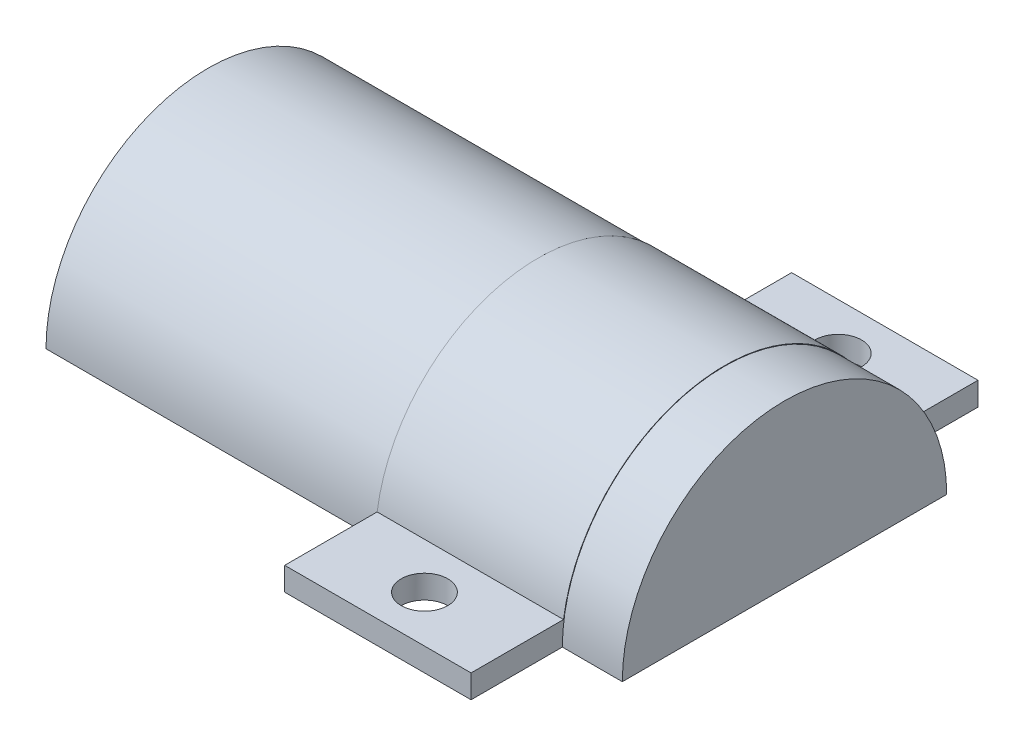
ISO-10303-21;
HEADER;
FILE_DESCRIPTION(('STEP AP214'),'2;1');
FILE_NAME('part.step','',(''),(''),'','','');
FILE_SCHEMA(('AUTOMOTIVE_DESIGN { 1 0 10303 214 1 1 1 1 }'));
ENDSEC;
DATA;
#1=APPLICATION_CONTEXT('core data for automotive mechanical design processes');
#2=APPLICATION_PROTOCOL_DEFINITION('international standard','automotive_design',2000,#1);
#3=PRODUCT_CONTEXT('',#1,'mechanical');
#4=PRODUCT('Part','Part','',(#3));
#5=PRODUCT_RELATED_PRODUCT_CATEGORY('part','',(#4));
#6=PRODUCT_DEFINITION_FORMATION('','',#4);
#7=PRODUCT_DEFINITION_CONTEXT('part definition',#1,'design');
#8=PRODUCT_DEFINITION('design','',#6,#7);
#9=PRODUCT_DEFINITION_SHAPE('','',#8);
#10=(LENGTH_UNIT() NAMED_UNIT(*) SI_UNIT(.MILLI.,.METRE.));
#11=(NAMED_UNIT(*) PLANE_ANGLE_UNIT() SI_UNIT($,.RADIAN.));
#12=(NAMED_UNIT(*) SI_UNIT($,.STERADIAN.) SOLID_ANGLE_UNIT());
#13=UNCERTAINTY_MEASURE_WITH_UNIT(LENGTH_MEASURE(1.E-05),#10,'distance_accuracy_value','');
#14=(GEOMETRIC_REPRESENTATION_CONTEXT(3) GLOBAL_UNCERTAINTY_ASSIGNED_CONTEXT((#13)) GLOBAL_UNIT_ASSIGNED_CONTEXT((#10,
#11,#12)) REPRESENTATION_CONTEXT('',''));
#15=CARTESIAN_POINT('',(0.,0.,0.));
#16=DIRECTION('',(0.,0.,1.));
#17=DIRECTION('',(1.,0.,0.));
#18=AXIS2_PLACEMENT_3D('',#15,#16,#17);
#19=CARTESIAN_POINT('',(25.4,0.,0.));
#20=DIRECTION('',(-1.,0.,0.));
#21=DIRECTION('',(0.,0.,1.));
#22=AXIS2_PLACEMENT_3D('',#19,#20,#21);
#23=CYLINDRICAL_SURFACE('',#22,19.);
#24=DIRECTION('',(-1.,0.,0.));
#25=VECTOR('',#24,1.);
#26=CARTESIAN_POINT('',(25.4,0.,19.));
#27=LINE('',#26,#25);
#28=CARTESIAN_POINT('',(30.4,0.,19.));
#29=VERTEX_POINT('',#28);
#30=CARTESIAN_POINT('',(-45.,0.,19.));
#31=VERTEX_POINT('',#30);
#32=EDGE_CURVE('E11',#29,#31,#27,.T.);
#33=ORIENTED_EDGE('',*,*,#32,.T.);
#34=CARTESIAN_POINT('',(-45.,0.,0.));
#35=DIRECTION('',(-1.,0.,0.));
#36=DIRECTION('',(0.,0.,1.));
#37=AXIS2_PLACEMENT_3D('',#34,#35,#36);
#38=CIRCLE('',#37,19.);
#39=CARTESIAN_POINT('',(-45.,0.,-19.));
#40=VERTEX_POINT('',#39);
#41=EDGE_CURVE('E140',#40,#31,#38,.F.);
#42=ORIENTED_EDGE('',*,*,#41,.F.);
#43=DIRECTION('',(-1.,0.,0.));
#44=VECTOR('',#43,1.);
#45=CARTESIAN_POINT('',(25.4,0.,-19.));
#46=LINE('',#45,#44);
#47=CARTESIAN_POINT('',(30.4,0.,-19.));
#48=VERTEX_POINT('',#47);
#49=EDGE_CURVE('E43',#48,#40,#46,.T.);
#50=ORIENTED_EDGE('',*,*,#49,.F.);
#51=CARTESIAN_POINT('',(30.4,0.,0.));
#52=DIRECTION('',(1.,0.,0.));
#53=DIRECTION('',(0.,0.,-1.));
#54=AXIS2_PLACEMENT_3D('',#51,#52,#53);
#55=CIRCLE('',#54,19.);
#56=EDGE_CURVE('E160',#29,#48,#55,.F.);
#57=ORIENTED_EDGE('',*,*,#56,.F.);
#58=EDGE_LOOP('',(#33,#42,#50,#57));
#59=FACE_BOUND('',#58,.T.);
#60=ADVANCED_FACE('F36',(#59),#23,.F.);
#61=CARTESIAN_POINT('',(25.4,0.,0.));
#62=DIRECTION('',(0.,1.,0.));
#63=DIRECTION('',(0.,0.,1.));
#64=AXIS2_PLACEMENT_3D('',#61,#62,#63);
#65=PLANE('',#64);
#66=CARTESIAN_POINT('',(12.7,0.,-28.1965259209744));
#67=DIRECTION('',(0.,1.,0.));
#68=DIRECTION('',(0.,0.,1.));
#69=AXIS2_PLACEMENT_3D('',#66,#67,#68);
#70=CIRCLE('',#69,3.175);
#71=CARTESIAN_POINT('',(12.7,0.,-25.0215259209744));
#72=VERTEX_POINT('',#71);
#73=EDGE_CURVE('E173',#72,#72,#70,.T.);
#74=ORIENTED_EDGE('',*,*,#73,.T.);
#75=EDGE_LOOP('',(#74));
#76=FACE_BOUND('',#75,.T.);
#77=ORIENTED_EDGE('',*,*,#49,.T.);
#78=DIRECTION('',(0.,0.,1.));
#79=VECTOR('',#78,1.);
#80=CARTESIAN_POINT('',(-45.,0.,0.));
#81=LINE('',#80,#79);
#82=CARTESIAN_POINT('',(-45.,0.,-22.0796898983033));
#83=VERTEX_POINT('',#82);
#84=EDGE_CURVE('E133',#83,#40,#81,.T.);
#85=ORIENTED_EDGE('',*,*,#84,.F.);
#86=DIRECTION('',(1.,0.,0.));
#87=VECTOR('',#86,1.);
#88=CARTESIAN_POINT('',(-45.,0.,-22.0796898983033));
#89=LINE('',#88,#87);
#90=CARTESIAN_POINT('',(0.,0.,-22.0796898983033));
#91=VERTEX_POINT('',#90);
#92=EDGE_CURVE('E129',#83,#91,#89,.T.);
#93=ORIENTED_EDGE('',*,*,#92,.T.);
#94=DIRECTION('',(0.,0.,-1.));
#95=VECTOR('',#94,1.);
#96=CARTESIAN_POINT('',(0.,0.,0.));
#97=LINE('',#96,#95);
#98=CARTESIAN_POINT('',(0.,0.,-34.5465259209744));
#99=VERTEX_POINT('',#98);
#100=EDGE_CURVE('E201',#91,#99,#97,.T.);
#101=ORIENTED_EDGE('',*,*,#100,.T.);
#102=DIRECTION('',(-1.,0.,0.));
#103=VECTOR('',#102,1.);
#104=CARTESIAN_POINT('',(25.4,0.,-34.5465259209744));
#105=LINE('',#104,#103);
#106=CARTESIAN_POINT('',(25.4,0.,-34.5465259209744));
#107=VERTEX_POINT('',#106);
#108=EDGE_CURVE('E226',#107,#99,#105,.T.);
#109=ORIENTED_EDGE('',*,*,#108,.F.);
#110=DIRECTION('',(0.,0.,-1.));
#111=VECTOR('',#110,1.);
#112=CARTESIAN_POINT('',(25.4,0.,0.));
#113=LINE('',#112,#111);
#114=CARTESIAN_POINT('',(25.4,0.,-22.1046519776116));
#115=VERTEX_POINT('',#114);
#116=EDGE_CURVE('E184',#115,#107,#113,.T.);
#117=ORIENTED_EDGE('',*,*,#116,.F.);
#118=DIRECTION('',(-1.,0.,0.));
#119=VECTOR('',#118,1.);
#120=CARTESIAN_POINT('',(30.4,0.,-22.1046519776116));
#121=LINE('',#120,#119);
#122=CARTESIAN_POINT('',(33.575,0.,-22.1046519776116));
#123=VERTEX_POINT('',#122);
#124=EDGE_CURVE('E167',#123,#115,#121,.T.);
#125=ORIENTED_EDGE('',*,*,#124,.F.);
#126=DIRECTION('',(0.,0.,-1.));
#127=VECTOR('',#126,1.);
#128=CARTESIAN_POINT('',(33.575,0.,0.));
#129=LINE('',#128,#127);
#130=CARTESIAN_POINT('',(33.575,0.,22.1046519776116));
#131=VERTEX_POINT('',#130);
#132=EDGE_CURVE('E150',#131,#123,#129,.T.);
#133=ORIENTED_EDGE('',*,*,#132,.F.);
#134=DIRECTION('',(-1.,0.,0.));
#135=VECTOR('',#134,1.);
#136=CARTESIAN_POINT('',(30.4,0.,22.1046519776116));
#137=LINE('',#136,#135);
#138=CARTESIAN_POINT('',(25.4,0.,22.1046519776116));
#139=VERTEX_POINT('',#138);
#140=EDGE_CURVE('E163',#131,#139,#137,.T.);
#141=ORIENTED_EDGE('',*,*,#140,.T.);
#142=DIRECTION('',(0.,0.,1.));
#143=VECTOR('',#142,1.);
#144=CARTESIAN_POINT('',(25.4,0.,0.));
#145=LINE('',#144,#143);
#146=CARTESIAN_POINT('',(25.4,0.,34.5465259209744));
#147=VERTEX_POINT('',#146);
#148=EDGE_CURVE('E182',#139,#147,#145,.T.);
#149=ORIENTED_EDGE('',*,*,#148,.T.);
#150=DIRECTION('',(-1.,0.,0.));
#151=VECTOR('',#150,1.);
#152=CARTESIAN_POINT('',(25.4,0.,34.5465259209744));
#153=LINE('',#152,#151);
#154=CARTESIAN_POINT('',(0.,0.,34.5465259209744));
#155=VERTEX_POINT('',#154);
#156=EDGE_CURVE('E199',#147,#155,#153,.T.);
#157=ORIENTED_EDGE('',*,*,#156,.T.);
#158=DIRECTION('',(0.,0.,1.));
#159=VECTOR('',#158,1.);
#160=CARTESIAN_POINT('',(0.,0.,0.));
#161=LINE('',#160,#159);
#162=CARTESIAN_POINT('',(0.,0.,22.0796898983033));
#163=VERTEX_POINT('',#162);
#164=EDGE_CURVE('E146',#163,#155,#161,.T.);
#165=ORIENTED_EDGE('',*,*,#164,.F.);
#166=DIRECTION('',(1.,0.,0.));
#167=VECTOR('',#166,1.);
#168=CARTESIAN_POINT('',(-45.,0.,22.0796898983033));
#169=LINE('',#168,#167);
#170=CARTESIAN_POINT('',(-45.,0.,22.0796898983033));
#171=VERTEX_POINT('',#170);
#172=EDGE_CURVE('E127',#171,#163,#169,.T.);
#173=ORIENTED_EDGE('',*,*,#172,.F.);
#174=DIRECTION('',(0.,0.,1.));
#175=VECTOR('',#174,1.);
#176=CARTESIAN_POINT('',(-45.,0.,0.));
#177=LINE('',#176,#175);
#178=EDGE_CURVE('E134',#31,#171,#177,.T.);
#179=ORIENTED_EDGE('',*,*,#178,.F.);
#180=ORIENTED_EDGE('',*,*,#32,.F.);
#181=DIRECTION('',(0.,0.,-1.));
#182=VECTOR('',#181,1.);
#183=CARTESIAN_POINT('',(30.4,0.,0.));
#184=LINE('',#183,#182);
#185=EDGE_CURVE('E147',#29,#48,#184,.T.);
#186=ORIENTED_EDGE('',*,*,#185,.T.);
#187=EDGE_LOOP('',(#77,#85,#93,#101,#109,#117,#125,#133,#141,#149,#157,#165,#173,#179,#180,#186));
#188=FACE_BOUND('',#187,.T.);
#189=CARTESIAN_POINT('',(12.7,0.,28.1965259209744));
#190=DIRECTION('',(0.,-1.,0.));
#191=DIRECTION('',(0.,0.,-1.));
#192=AXIS2_PLACEMENT_3D('',#189,#190,#191);
#193=CIRCLE('',#192,3.175);
#194=CARTESIAN_POINT('',(12.7,0.,25.0215259209744));
#195=VERTEX_POINT('',#194);
#196=EDGE_CURVE('E179',#195,#195,#193,.T.);
#197=ORIENTED_EDGE('',*,*,#196,.F.);
#198=EDGE_LOOP('',(#197));
#199=FACE_BOUND('',#198,.T.);
#200=ADVANCED_FACE('F143',(#76,#188,#199),#65,.F.);
#201=CARTESIAN_POINT('',(25.4,0.,-34.5465259209744));
#202=DIRECTION('',(0.,0.,1.));
#203=DIRECTION('',(1.,0.,0.));
#204=AXIS2_PLACEMENT_3D('',#201,#202,#203);
#205=PLANE('',#204);
#206=DIRECTION('',(0.,1.,0.));
#207=VECTOR('',#206,1.);
#208=CARTESIAN_POINT('',(0.,0.,-34.5465259209744));
#209=LINE('',#208,#207);
#210=CARTESIAN_POINT('',(0.,3.17500000000001,-34.5465259209744));
#211=VERTEX_POINT('',#210);
#212=EDGE_CURVE('E203',#99,#211,#209,.T.);
#213=ORIENTED_EDGE('',*,*,#212,.T.);
#214=DIRECTION('',(-1.,0.,0.));
#215=VECTOR('',#214,1.);
#216=CARTESIAN_POINT('',(25.4,3.17500000000001,-34.5465259209744));
#217=LINE('',#216,#215);
#218=CARTESIAN_POINT('',(25.4,3.17500000000001,-34.5465259209744));
#219=VERTEX_POINT('',#218);
#220=EDGE_CURVE('E223',#219,#211,#217,.T.);
#221=ORIENTED_EDGE('',*,*,#220,.F.);
#222=DIRECTION('',(0.,1.,0.));
#223=VECTOR('',#222,1.);
#224=CARTESIAN_POINT('',(25.4,0.,-34.5465259209744));
#225=LINE('',#224,#223);
#226=EDGE_CURVE('E187',#107,#219,#225,.T.);
#227=ORIENTED_EDGE('',*,*,#226,.F.);
#228=ORIENTED_EDGE('',*,*,#108,.T.);
#229=EDGE_LOOP('',(#213,#221,#227,#228));
#230=FACE_BOUND('',#229,.T.);
#231=ADVANCED_FACE('F237',(#230),#205,.F.);
#232=CARTESIAN_POINT('',(25.4,3.175,0.));
#233=DIRECTION('',(0.,-1.,0.));
#234=DIRECTION('',(0.,0.,-1.));
#235=AXIS2_PLACEMENT_3D('',#232,#233,#234);
#236=PLANE('',#235);
#237=CARTESIAN_POINT('',(12.7,3.175,-28.1965259209744));
#238=DIRECTION('',(0.,1.,0.));
#239=DIRECTION('',(0.,0.,1.));
#240=AXIS2_PLACEMENT_3D('',#237,#238,#239);
#241=CIRCLE('',#240,3.175);
#242=CARTESIAN_POINT('',(12.7,3.175,-25.0215259209744));
#243=VERTEX_POINT('',#242);
#244=EDGE_CURVE('E170',#243,#243,#241,.T.);
#245=ORIENTED_EDGE('',*,*,#244,.F.);
#246=EDGE_LOOP('',(#245));
#247=FACE_BOUND('',#246,.T.);
#248=DIRECTION('',(0.,0.,1.));
#249=VECTOR('',#248,1.);
#250=CARTESIAN_POINT('',(0.,3.175,0.));
#251=LINE('',#250,#249);
#252=CARTESIAN_POINT('',(0.,3.175,-21.9465259209744));
#253=VERTEX_POINT('',#252);
#254=EDGE_CURVE('E205',#211,#253,#251,.T.);
#255=ORIENTED_EDGE('',*,*,#254,.T.);
#256=DIRECTION('',(-1.,0.,0.));
#257=VECTOR('',#256,1.);
#258=CARTESIAN_POINT('',(25.4,3.175,-21.9465259209744));
#259=LINE('',#258,#257);
#260=CARTESIAN_POINT('',(25.4,3.175,-21.9465259209744));
#261=VERTEX_POINT('',#260);
#262=EDGE_CURVE('E220',#261,#253,#259,.T.);
#263=ORIENTED_EDGE('',*,*,#262,.F.);
#264=DIRECTION('',(0.,0.,1.));
#265=VECTOR('',#264,1.);
#266=CARTESIAN_POINT('',(25.4,3.175,0.));
#267=LINE('',#266,#265);
#268=EDGE_CURVE('E189',#219,#261,#267,.T.);
#269=ORIENTED_EDGE('',*,*,#268,.F.);
#270=ORIENTED_EDGE('',*,*,#220,.T.);
#271=EDGE_LOOP('',(#255,#263,#269,#270));
#272=FACE_BOUND('',#271,.T.);
#273=ADVANCED_FACE('F244',(#247,#272),#236,.F.);
#274=CARTESIAN_POINT('',(25.4,0.,0.));
#275=DIRECTION('',(-1.,0.,0.));
#276=DIRECTION('',(0.,0.,1.));
#277=AXIS2_PLACEMENT_3D('',#274,#275,#276);
#278=CYLINDRICAL_SURFACE('',#277,22.175);
#279=CARTESIAN_POINT('',(0.,0.,0.));
#280=DIRECTION('',(1.,0.,0.));
#281=DIRECTION('',(0.,0.,-1.));
#282=AXIS2_PLACEMENT_3D('',#279,#280,#281);
#283=CIRCLE('',#282,22.175);
#284=CARTESIAN_POINT('',(0.,3.175,21.9465259209744));
#285=VERTEX_POINT('',#284);
#286=EDGE_CURVE('E207',#253,#285,#283,.T.);
#287=ORIENTED_EDGE('',*,*,#286,.T.);
#288=DIRECTION('',(-1.,0.,0.));
#289=VECTOR('',#288,1.);
#290=CARTESIAN_POINT('',(25.4,3.175,21.9465259209744));
#291=LINE('',#290,#289);
#292=CARTESIAN_POINT('',(25.4,3.175,21.9465259209744));
#293=VERTEX_POINT('',#292);
#294=EDGE_CURVE('E218',#293,#285,#291,.T.);
#295=ORIENTED_EDGE('',*,*,#294,.F.);
#296=CARTESIAN_POINT('',(25.4,0.,0.));
#297=DIRECTION('',(1.,0.,0.));
#298=DIRECTION('',(0.,0.,-1.));
#299=AXIS2_PLACEMENT_3D('',#296,#297,#298);
#300=CIRCLE('',#299,22.175);
#301=EDGE_CURVE('E191',#261,#293,#300,.T.);
#302=ORIENTED_EDGE('',*,*,#301,.F.);
#303=ORIENTED_EDGE('',*,*,#262,.T.);
#304=EDGE_LOOP('',(#287,#295,#302,#303));
#305=FACE_BOUND('',#304,.T.);
#306=ADVANCED_FACE('F248',(#305),#278,.T.);
#307=CARTESIAN_POINT('',(25.4,3.175,0.));
#308=DIRECTION('',(0.,1.,0.));
#309=DIRECTION('',(0.,0.,1.));
#310=AXIS2_PLACEMENT_3D('',#307,#308,#309);
#311=PLANE('',#310);
#312=CARTESIAN_POINT('',(12.7,3.175,28.1965259209744));
#313=DIRECTION('',(0.,1.,0.));
#314=DIRECTION('',(0.,0.,1.));
#315=AXIS2_PLACEMENT_3D('',#312,#313,#314);
#316=CIRCLE('',#315,3.175);
#317=CARTESIAN_POINT('',(12.7,3.175,31.3715259209744));
#318=VERTEX_POINT('',#317);
#319=EDGE_CURVE('E176',#318,#318,#316,.T.);
#320=ORIENTED_EDGE('',*,*,#319,.F.);
#321=EDGE_LOOP('',(#320));
#322=FACE_BOUND('',#321,.T.);
#323=DIRECTION('',(0.,0.,-1.));
#324=VECTOR('',#323,1.);
#325=CARTESIAN_POINT('',(0.,3.175,0.));
#326=LINE('',#325,#324);
#327=CARTESIAN_POINT('',(0.,3.175,34.5465259209744));
#328=VERTEX_POINT('',#327);
#329=EDGE_CURVE('E210',#328,#285,#326,.T.);
#330=ORIENTED_EDGE('',*,*,#329,.F.);
#331=DIRECTION('',(-1.,0.,0.));
#332=VECTOR('',#331,1.);
#333=CARTESIAN_POINT('',(25.4,3.175,34.5465259209744));
#334=LINE('',#333,#332);
#335=CARTESIAN_POINT('',(25.4,3.175,34.5465259209744));
#336=VERTEX_POINT('',#335);
#337=EDGE_CURVE('E216',#336,#328,#334,.T.);
#338=ORIENTED_EDGE('',*,*,#337,.F.);
#339=DIRECTION('',(0.,0.,-1.));
#340=VECTOR('',#339,1.);
#341=CARTESIAN_POINT('',(25.4,3.175,0.));
#342=LINE('',#341,#340);
#343=EDGE_CURVE('E193',#336,#293,#342,.T.);
#344=ORIENTED_EDGE('',*,*,#343,.T.);
#345=ORIENTED_EDGE('',*,*,#294,.T.);
#346=EDGE_LOOP('',(#330,#338,#344,#345));
#347=FACE_BOUND('',#346,.T.);
#348=ADVANCED_FACE('F265',(#322,#347),#311,.T.);
#349=CARTESIAN_POINT('',(25.4,0.,34.5465259209744));
#350=DIRECTION('',(0.,0.,1.));
#351=DIRECTION('',(1.,0.,0.));
#352=AXIS2_PLACEMENT_3D('',#349,#350,#351);
#353=PLANE('',#352);
#354=DIRECTION('',(0.,1.,0.));
#355=VECTOR('',#354,1.);
#356=CARTESIAN_POINT('',(0.,0.,34.5465259209744));
#357=LINE('',#356,#355);
#358=EDGE_CURVE('E185',#155,#328,#357,.T.);
#359=ORIENTED_EDGE('',*,*,#358,.F.);
#360=ORIENTED_EDGE('',*,*,#156,.F.);
#361=DIRECTION('',(0.,1.,0.));
#362=VECTOR('',#361,1.);
#363=CARTESIAN_POINT('',(25.4,0.,34.5465259209744));
#364=LINE('',#363,#362);
#365=EDGE_CURVE('E196',#147,#336,#364,.T.);
#366=ORIENTED_EDGE('',*,*,#365,.T.);
#367=ORIENTED_EDGE('',*,*,#337,.T.);
#368=EDGE_LOOP('',(#359,#360,#366,#367));
#369=FACE_BOUND('',#368,.T.);
#370=ADVANCED_FACE('F262',(#369),#353,.T.);
#371=CARTESIAN_POINT('',(25.4,0.,0.));
#372=DIRECTION('',(1.,0.,0.));
#373=DIRECTION('',(0.,0.,-1.));
#374=AXIS2_PLACEMENT_3D('',#371,#372,#373);
#375=PLANE('',#374);
#376=CARTESIAN_POINT('',(25.4,0.,0.));
#377=DIRECTION('',(1.,0.,0.));
#378=DIRECTION('',(0.,0.,-1.));
#379=AXIS2_PLACEMENT_3D('',#376,#377,#378);
#380=CIRCLE('',#379,22.1046519776116);
#381=EDGE_CURVE('E58',#115,#139,#380,.T.);
#382=ORIENTED_EDGE('',*,*,#381,.F.);
#383=ORIENTED_EDGE('',*,*,#116,.T.);
#384=ORIENTED_EDGE('',*,*,#226,.T.);
#385=ORIENTED_EDGE('',*,*,#268,.T.);
#386=ORIENTED_EDGE('',*,*,#301,.T.);
#387=ORIENTED_EDGE('',*,*,#343,.F.);
#388=ORIENTED_EDGE('',*,*,#365,.F.);
#389=ORIENTED_EDGE('',*,*,#148,.F.);
#390=EDGE_LOOP('',(#382,#383,#384,#385,#386,#387,#388,#389));
#391=FACE_BOUND('',#390,.T.);
#392=ADVANCED_FACE('F251',(#391),#375,.T.);
#393=CARTESIAN_POINT('',(0.,0.,0.));
#394=DIRECTION('',(1.,0.,0.));
#395=DIRECTION('',(0.,0.,-1.));
#396=AXIS2_PLACEMENT_3D('',#393,#394,#395);
#397=PLANE('',#396);
#398=CARTESIAN_POINT('',(0.,0.,0.));
#399=DIRECTION('',(-1.,0.,0.));
#400=DIRECTION('',(0.,0.,1.));
#401=AXIS2_PLACEMENT_3D('',#398,#399,#400);
#402=CIRCLE('',#401,22.0796898983033);
#403=EDGE_CURVE('E50',#163,#91,#402,.T.);
#404=ORIENTED_EDGE('',*,*,#403,.F.);
#405=ORIENTED_EDGE('',*,*,#164,.T.);
#406=ORIENTED_EDGE('',*,*,#358,.T.);
#407=ORIENTED_EDGE('',*,*,#329,.T.);
#408=ORIENTED_EDGE('',*,*,#286,.F.);
#409=ORIENTED_EDGE('',*,*,#254,.F.);
#410=ORIENTED_EDGE('',*,*,#212,.F.);
#411=ORIENTED_EDGE('',*,*,#100,.F.);
#412=EDGE_LOOP('',(#404,#405,#406,#407,#408,#409,#410,#411));
#413=FACE_BOUND('',#412,.T.);
#414=ADVANCED_FACE('F240',(#413),#397,.F.);
#415=CARTESIAN_POINT('',(12.7,-22.225,28.1965259209744));
#416=DIRECTION('',(0.,1.,0.));
#417=DIRECTION('',(0.,0.,1.));
#418=AXIS2_PLACEMENT_3D('',#415,#416,#417);
#419=CYLINDRICAL_SURFACE('',#418,3.175);
#420=ORIENTED_EDGE('',*,*,#196,.T.);
#421=EDGE_LOOP('',(#420));
#422=FACE_BOUND('',#421,.T.);
#423=ORIENTED_EDGE('',*,*,#319,.T.);
#424=EDGE_LOOP('',(#423));
#425=FACE_BOUND('',#424,.T.);
#426=ADVANCED_FACE('F295',(#422,#425),#419,.F.);
#427=CARTESIAN_POINT('',(12.7,-22.225,-28.1965259209744));
#428=DIRECTION('',(0.,1.,0.));
#429=DIRECTION('',(0.,0.,1.));
#430=AXIS2_PLACEMENT_3D('',#427,#428,#429);
#431=CYLINDRICAL_SURFACE('',#430,3.175);
#432=ORIENTED_EDGE('',*,*,#244,.T.);
#433=EDGE_LOOP('',(#432));
#434=FACE_BOUND('',#433,.T.);
#435=ORIENTED_EDGE('',*,*,#73,.F.);
#436=EDGE_LOOP('',(#435));
#437=FACE_BOUND('',#436,.T.);
#438=ADVANCED_FACE('F292',(#434,#437),#431,.F.);
#439=CARTESIAN_POINT('',(30.4,0.,0.));
#440=DIRECTION('',(-1.,0.,0.));
#441=DIRECTION('',(0.,0.,1.));
#442=AXIS2_PLACEMENT_3D('',#439,#440,#441);
#443=CYLINDRICAL_SURFACE('',#442,22.1046519776116);
#444=ORIENTED_EDGE('',*,*,#381,.T.);
#445=ORIENTED_EDGE('',*,*,#140,.F.);
#446=CARTESIAN_POINT('',(33.575,0.,0.));
#447=DIRECTION('',(1.,0.,0.));
#448=DIRECTION('',(0.,0.,-1.));
#449=AXIS2_PLACEMENT_3D('',#446,#447,#448);
#450=CIRCLE('',#449,22.1046519776116);
#451=EDGE_CURVE('E157',#123,#131,#450,.T.);
#452=ORIENTED_EDGE('',*,*,#451,.F.);
#453=ORIENTED_EDGE('',*,*,#124,.T.);
#454=EDGE_LOOP('',(#444,#445,#452,#453));
#455=FACE_BOUND('',#454,.T.);
#456=ADVANCED_FACE('F256',(#455),#443,.T.);
#457=CARTESIAN_POINT('',(30.4,0.,0.));
#458=DIRECTION('',(1.,0.,0.));
#459=DIRECTION('',(0.,0.,-1.));
#460=AXIS2_PLACEMENT_3D('',#457,#458,#459);
#461=PLANE('',#460);
#462=ORIENTED_EDGE('',*,*,#185,.F.);
#463=ORIENTED_EDGE('',*,*,#56,.T.);
#464=EDGE_LOOP('',(#462,#463));
#465=FACE_BOUND('',#464,.T.);
#466=ADVANCED_FACE('F302',(#465),#461,.F.);
#467=CARTESIAN_POINT('',(33.575,0.,0.));
#468=DIRECTION('',(1.,0.,0.));
#469=DIRECTION('',(0.,0.,-1.));
#470=AXIS2_PLACEMENT_3D('',#467,#468,#469);
#471=PLANE('',#470);
#472=ORIENTED_EDGE('',*,*,#132,.T.);
#473=ORIENTED_EDGE('',*,*,#451,.T.);
#474=EDGE_LOOP('',(#472,#473));
#475=FACE_BOUND('',#474,.T.);
#476=ADVANCED_FACE('F258',(#475),#471,.T.);
#477=CARTESIAN_POINT('',(-45.,0.,0.));
#478=DIRECTION('',(1.,0.,0.));
#479=DIRECTION('',(0.,0.,-1.));
#480=AXIS2_PLACEMENT_3D('',#477,#478,#479);
#481=CYLINDRICAL_SURFACE('',#480,22.0796898983033);
#482=ORIENTED_EDGE('',*,*,#403,.T.);
#483=ORIENTED_EDGE('',*,*,#92,.F.);
#484=CARTESIAN_POINT('',(-45.,0.,0.));
#485=DIRECTION('',(-1.,0.,0.));
#486=DIRECTION('',(0.,0.,1.));
#487=AXIS2_PLACEMENT_3D('',#484,#485,#486);
#488=CIRCLE('',#487,22.0796898983033);
#489=EDGE_CURVE('E123',#171,#83,#488,.T.);
#490=ORIENTED_EDGE('',*,*,#489,.F.);
#491=ORIENTED_EDGE('',*,*,#172,.T.);
#492=EDGE_LOOP('',(#482,#483,#490,#491));
#493=FACE_BOUND('',#492,.T.);
#494=ADVANCED_FACE('F125',(#493),#481,.T.);
#495=CARTESIAN_POINT('',(-45.,0.,0.));
#496=DIRECTION('',(-1.,0.,0.));
#497=DIRECTION('',(0.,0.,1.));
#498=AXIS2_PLACEMENT_3D('',#495,#496,#497);
#499=PLANE('',#498);
#500=ORIENTED_EDGE('',*,*,#178,.T.);
#501=ORIENTED_EDGE('',*,*,#489,.T.);
#502=ORIENTED_EDGE('',*,*,#84,.T.);
#503=ORIENTED_EDGE('',*,*,#41,.T.);
#504=EDGE_LOOP('',(#500,#501,#502,#503));
#505=FACE_BOUND('',#504,.T.);
#506=ADVANCED_FACE('F138',(#505),#499,.T.);
#507=CLOSED_SHELL('',(#60,#200,#231,#273,#306,#348,#370,#392,#414,#426,#438,#456,#466,#476,#494,#506));
#508=MANIFOLD_SOLID_BREP('B2',#507);
#509=ADVANCED_BREP_SHAPE_REPRESENTATION('',(#18,#508),#14);
#510=SHAPE_DEFINITION_REPRESENTATION(#9,#509);
ENDSEC;
END-ISO-10303-21;
